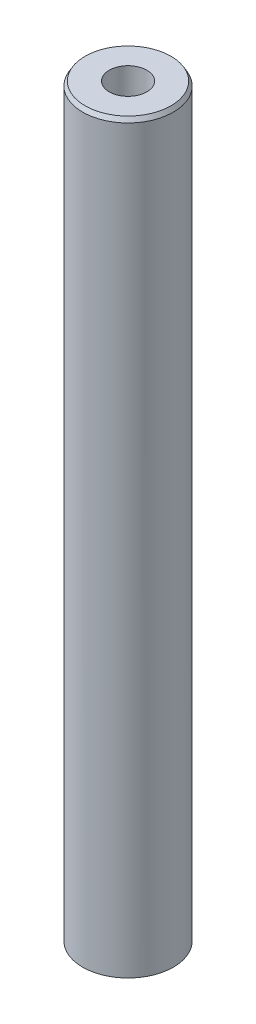
ISO-10303-21;
HEADER;
FILE_DESCRIPTION(('STEP AP214'),'2;1');
FILE_NAME('part.step','',(''),(''),'','','');
FILE_SCHEMA(('AUTOMOTIVE_DESIGN { 1 0 10303 214 1 1 1 1 }'));
ENDSEC;
DATA;
#1=APPLICATION_CONTEXT('core data for automotive mechanical design processes');
#2=APPLICATION_PROTOCOL_DEFINITION('international standard','automotive_design',2000,#1);
#3=PRODUCT_CONTEXT('',#1,'mechanical');
#4=PRODUCT('Part','Part','',(#3));
#5=PRODUCT_RELATED_PRODUCT_CATEGORY('part','',(#4));
#6=PRODUCT_DEFINITION_FORMATION('','',#4);
#7=PRODUCT_DEFINITION_CONTEXT('part definition',#1,'design');
#8=PRODUCT_DEFINITION('design','',#6,#7);
#9=PRODUCT_DEFINITION_SHAPE('','',#8);
#10=(LENGTH_UNIT() NAMED_UNIT(*) SI_UNIT(.MILLI.,.METRE.));
#11=(NAMED_UNIT(*) PLANE_ANGLE_UNIT() SI_UNIT($,.RADIAN.));
#12=(NAMED_UNIT(*) SI_UNIT($,.STERADIAN.) SOLID_ANGLE_UNIT());
#13=UNCERTAINTY_MEASURE_WITH_UNIT(LENGTH_MEASURE(1.E-05),#10,'distance_accuracy_value','');
#14=(GEOMETRIC_REPRESENTATION_CONTEXT(3) GLOBAL_UNCERTAINTY_ASSIGNED_CONTEXT((#13)) GLOBAL_UNIT_ASSIGNED_CONTEXT((#10,
#11,#12)) REPRESENTATION_CONTEXT('',''));
#15=CARTESIAN_POINT('',(0.,0.,0.));
#16=DIRECTION('',(0.,0.,1.));
#17=DIRECTION('',(1.,0.,0.));
#18=AXIS2_PLACEMENT_3D('',#15,#16,#17);
#19=CARTESIAN_POINT('',(0.,164.60756164385,0.));
#20=DIRECTION('',(0.,-1.,0.));
#21=DIRECTION('',(0.,0.,-1.));
#22=AXIS2_PLACEMENT_3D('',#19,#20,#21);
#23=CYLINDRICAL_SURFACE('',#22,10.);
#24=CARTESIAN_POINT('',(0.,163.669523991613,0.));
#25=DIRECTION('',(0.,1.,0.));
#26=DIRECTION('',(0.,0.,1.));
#27=AXIS2_PLACEMENT_3D('',#24,#25,#26);
#28=CIRCLE('',#27,10.);
#29=CARTESIAN_POINT('',(0.,163.669523991613,-10.));
#30=VERTEX_POINT('',#29);
#31=EDGE_CURVE('E50',#30,#30,#28,.F.);
#32=CARTESIAN_POINT('',(0.,0.541576291029106,0.));
#33=DIRECTION('',(0.,1.,0.));
#34=DIRECTION('',(0.,0.,1.));
#35=AXIS2_PLACEMENT_3D('',#32,#33,#34);
#36=CIRCLE('',#35,10.);
#37=CARTESIAN_POINT('',(0.,0.541576291029106,-10.));
#38=VERTEX_POINT('',#37);
#39=EDGE_CURVE('E51',#38,#38,#36,.T.);
#40=CARTESIAN_POINT('',(0.,163.669523991613,-10.));
#41=CARTESIAN_POINT('',(0.,161.970274536399,-10.));
#42=CARTESIAN_POINT('',(0.,160.271025081184,-10.));
#43=CARTESIAN_POINT('',(0.,156.872526170755,-10.));
#44=CARTESIAN_POINT('',(0.,155.173276715541,-10.));
#45=CARTESIAN_POINT('',(0.,151.774777805112,-10.));
#46=CARTESIAN_POINT('',(0.,150.075528349898,-10.));
#47=CARTESIAN_POINT('',(0.,146.677029439469,-10.));
#48=CARTESIAN_POINT('',(0.,144.977779984255,-10.));
#49=CARTESIAN_POINT('',(0.,141.579281073826,-10.));
#50=CARTESIAN_POINT('',(0.,139.880031618611,-10.));
#51=CARTESIAN_POINT('',(0.,136.481532708182,-10.));
#52=CARTESIAN_POINT('',(0.,134.782283252968,-10.));
#53=CARTESIAN_POINT('',(0.,131.383784342539,-10.));
#54=CARTESIAN_POINT('',(0.,129.684534887325,-10.));
#55=CARTESIAN_POINT('',(0.,126.286035976896,-10.));
#56=CARTESIAN_POINT('',(0.,124.586786521682,-10.));
#57=CARTESIAN_POINT('',(0.,121.188287611253,-10.));
#58=CARTESIAN_POINT('',(0.,119.489038156038,-10.));
#59=CARTESIAN_POINT('',(0.,116.090539245609,-10.));
#60=CARTESIAN_POINT('',(0.,114.391289790395,-10.));
#61=CARTESIAN_POINT('',(0.,110.992790879966,-10.));
#62=CARTESIAN_POINT('',(0.,109.293541424752,-10.));
#63=CARTESIAN_POINT('',(0.,105.895042514323,-10.));
#64=CARTESIAN_POINT('',(0.,104.195793059109,-10.));
#65=CARTESIAN_POINT('',(0.,100.79729414868,-10.));
#66=CARTESIAN_POINT('',(0.,99.0980446934653,-10.));
#67=CARTESIAN_POINT('',(0.,95.6995457830365,-10.));
#68=CARTESIAN_POINT('',(0.,94.0002963278221,-10.));
#69=CARTESIAN_POINT('',(0.,90.6017974173932,-10.));
#70=CARTESIAN_POINT('',(0.,88.9025479621788,-10.));
#71=CARTESIAN_POINT('',(0.,85.50404905175,-10.));
#72=CARTESIAN_POINT('',(0.,83.8047995965356,-10.));
#73=CARTESIAN_POINT('',(0.,80.4063006861067,-10.));
#74=CARTESIAN_POINT('',(0.,78.7070512308923,-10.));
#75=CARTESIAN_POINT('',(0.,75.3085523204635,-10.));
#76=CARTESIAN_POINT('',(0.,73.609302865249,-10.));
#77=CARTESIAN_POINT('',(0.,70.2108039548202,-10.));
#78=CARTESIAN_POINT('',(0.,68.5115544996058,-10.));
#79=CARTESIAN_POINT('',(0.,65.113055589177,-10.));
#80=CARTESIAN_POINT('',(0.,63.4138061339626,-10.));
#81=CARTESIAN_POINT('',(0.,60.0153072235337,-10.));
#82=CARTESIAN_POINT('',(0.,58.3160577683193,-10.));
#83=CARTESIAN_POINT('',(0.,54.9175588578905,-10.));
#84=CARTESIAN_POINT('',(0.,53.218309402676,-10.));
#85=CARTESIAN_POINT('',(0.,49.8198104922472,-10.));
#86=CARTESIAN_POINT('',(0.,48.1205610370328,-10.));
#87=CARTESIAN_POINT('',(0.,44.722062126604,-10.));
#88=CARTESIAN_POINT('',(0.,43.0228126713895,-10.));
#89=CARTESIAN_POINT('',(0.,39.6243137609607,-10.));
#90=CARTESIAN_POINT('',(0.,37.9250643057463,-10.));
#91=CARTESIAN_POINT('',(0.,34.5265653953174,-10.));
#92=CARTESIAN_POINT('',(0.,32.827315940103,-10.));
#93=CARTESIAN_POINT('',(0.,29.4288170296742,-10.));
#94=CARTESIAN_POINT('',(0.,27.7295675744598,-10.));
#95=CARTESIAN_POINT('',(0.,24.3310686640309,-10.));
#96=CARTESIAN_POINT('',(0.,22.6318192088165,-10.));
#97=CARTESIAN_POINT('',(0.,19.2333202983877,-10.));
#98=CARTESIAN_POINT('',(0.,17.5340708431733,-10.));
#99=CARTESIAN_POINT('',(0.,14.1355719327444,-10.));
#100=CARTESIAN_POINT('',(0.,12.43632247753,-10.));
#101=CARTESIAN_POINT('',(0.,9.03782356710119,-10.));
#102=CARTESIAN_POINT('',(0.,7.33857411188677,-10.));
#103=CARTESIAN_POINT('',(0.,3.94007520145794,-10.));
#104=CARTESIAN_POINT('',(0.,2.24082574624352,-10.));
#105=CARTESIAN_POINT('',(0.,0.541576291029106,-10.));
#106=B_SPLINE_CURVE_WITH_KNOTS('',3,(#40,#41,#42,#43,#44,#45,#46,#47,#48,#49,#50,#51,#52,#53,
#54,#55,#56,#57,#58,#59,#60,#61,#62,#63,#64,#65,#66,#67,#68,#69,#70,#71,#72,#73,#74,#75,#76,#77,
#78,#79,#80,#81,#82,#83,#84,#85,#86,#87,#88,#89,#90,#91,#92,#93,#94,#95,#96,#97,#98,#99,#100,
#101,#102,#103,#104,#105),.UNSPECIFIED.,.F.,.F.,(4,2,2,2,2,2,2,2,2,2,2,2,2,2,2,2,2,2,2,2,2,2,2,
2,2,2,2,2,2,2,2,2,4),(0.,5.09774836564322,10.1954967312865,15.2932450969297,20.390993462573,
25.4887418282162,30.5864901938595,35.6842385595027,40.781986925146,45.8797352907892,
50.9774836564325,56.0752320220757,61.172980387719,66.2707287533622,71.3684771190055,
76.4662254846487,81.563973850292,86.6617222159353,91.7594705815785,96.8572189472218,
101.954967312865,107.052715678508,112.150464044152,117.248212409795,122.345960775438,
127.443709141081,132.541457506725,137.639205872368,142.736954238011,147.834702603654,
152.932450969298,158.030199334941,163.127947700584),.UNSPECIFIED.);
#107=EDGE_CURVE('BSEAM39',#30,#38,#106,.T.);
#108=ORIENTED_EDGE('',*,*,#31,.T.);
#109=ORIENTED_EDGE('',*,*,#39,.T.);
#110=ORIENTED_EDGE('',*,*,#107,.T.);
#111=ORIENTED_EDGE('',*,*,#107,.F.);
#112=EDGE_LOOP('',(#108,#110,#109,#111));
#113=FACE_BOUND('',#112,.T.);
#114=ADVANCED_FACE('F39',(#113),#23,.T.);
#115=CARTESIAN_POINT('',(0.,164.60756164385,0.));
#116=DIRECTION('',(0.,1.,0.));
#117=DIRECTION('',(0.,0.,1.));
#118=AXIS2_PLACEMENT_3D('',#115,#116,#117);
#119=PLANE('',#118);
#120=CARTESIAN_POINT('',(0.,164.60756164385,0.));
#121=DIRECTION('',(0.,1.,0.));
#122=DIRECTION('',(0.,0.,1.));
#123=AXIS2_PLACEMENT_3D('',#120,#121,#122);
#124=CIRCLE('',#123,9.4584237089711);
#125=CARTESIAN_POINT('',(0.,164.60756164385,-9.45842370897111));
#126=VERTEX_POINT('',#125);
#127=EDGE_CURVE('E54',#126,#126,#124,.T.);
#128=ORIENTED_EDGE('',*,*,#127,.T.);
#129=EDGE_LOOP('',(#128));
#130=FACE_BOUND('',#129,.T.);
#131=CARTESIAN_POINT('',(0.,164.60756164385,0.));
#132=DIRECTION('',(0.,1.,0.));
#133=DIRECTION('',(0.,0.,1.));
#134=AXIS2_PLACEMENT_3D('',#131,#132,#133);
#135=CIRCLE('',#134,4.14096781980479);
#136=CARTESIAN_POINT('',(0.,164.60756164385,-4.14096781980479));
#137=VERTEX_POINT('',#136);
#138=EDGE_CURVE('E58',#137,#137,#135,.T.);
#139=ORIENTED_EDGE('',*,*,#138,.F.);
#140=EDGE_LOOP('',(#139));
#141=FACE_BOUND('',#140,.T.);
#142=ADVANCED_FACE('F69',(#130,#141),#119,.T.);
#143=CARTESIAN_POINT('',(0.,0.,0.));
#144=DIRECTION('',(0.,1.,0.));
#145=DIRECTION('',(0.,0.,1.));
#146=AXIS2_PLACEMENT_3D('',#143,#144,#145);
#147=PLANE('',#146);
#148=CARTESIAN_POINT('',(0.,0.,0.));
#149=DIRECTION('',(0.,1.,0.));
#150=DIRECTION('',(0.,0.,1.));
#151=AXIS2_PLACEMENT_3D('',#148,#149,#150);
#152=CIRCLE('',#151,9.06196234776291);
#153=CARTESIAN_POINT('',(0.,0.,9.06196234776291));
#154=VERTEX_POINT('',#153);
#155=EDGE_CURVE('E10',#154,#154,#152,.F.);
#156=ORIENTED_EDGE('',*,*,#155,.T.);
#157=EDGE_LOOP('',(#156));
#158=FACE_BOUND('',#157,.T.);
#159=CARTESIAN_POINT('',(0.,0.,0.));
#160=DIRECTION('',(0.,1.,0.));
#161=DIRECTION('',(0.,0.,1.));
#162=AXIS2_PLACEMENT_3D('',#159,#160,#161);
#163=CIRCLE('',#162,4.14096781980479);
#164=CARTESIAN_POINT('',(0.,0.,-4.14096781980479));
#165=VERTEX_POINT('',#164);
#166=EDGE_CURVE('E63',#165,#165,#163,.T.);
#167=ORIENTED_EDGE('',*,*,#166,.T.);
#168=EDGE_LOOP('',(#167));
#169=FACE_BOUND('',#168,.T.);
#170=ADVANCED_FACE('F75',(#158,#169),#147,.F.);
#171=CARTESIAN_POINT('',(0.,164.60756164385,0.));
#172=DIRECTION('',(0.,-1.,0.));
#173=DIRECTION('',(0.,0.,-1.));
#174=AXIS2_PLACEMENT_3D('',#171,#172,#173);
#175=CYLINDRICAL_SURFACE('',#174,4.14096781980479);
#176=CARTESIAN_POINT('',(0.,164.60756164385,-4.14096781980479));
#177=CARTESIAN_POINT('',(0.,162.892899543393,-4.14096781980479));
#178=CARTESIAN_POINT('',(0.,161.178237442936,-4.14096781980479));
#179=CARTESIAN_POINT('',(0.,157.748913242023,-4.14096781980479));
#180=CARTESIAN_POINT('',(0.,156.034251141566,-4.14096781980479));
#181=CARTESIAN_POINT('',(0.,152.604926940653,-4.14096781980479));
#182=CARTESIAN_POINT('',(0.,150.890264840196,-4.14096781980479));
#183=CARTESIAN_POINT('',(0.,147.460940639282,-4.14096781980479));
#184=CARTESIAN_POINT('',(0.,145.746278538825,-4.14096781980479));
#185=CARTESIAN_POINT('',(0.,142.316954337912,-4.14096781980479));
#186=CARTESIAN_POINT('',(0.,140.602292237455,-4.14096781980479));
#187=CARTESIAN_POINT('',(0.,137.172968036542,-4.14096781980479));
#188=CARTESIAN_POINT('',(0.,135.458305936085,-4.14096781980479));
#189=CARTESIAN_POINT('',(0.,132.028981735171,-4.14096781980479));
#190=CARTESIAN_POINT('',(0.,130.314319634714,-4.14096781980479));
#191=CARTESIAN_POINT('',(0.,126.884995433801,-4.14096781980479));
#192=CARTESIAN_POINT('',(0.,125.170333333344,-4.14096781980479));
#193=CARTESIAN_POINT('',(0.,121.741009132431,-4.14096781980479));
#194=CARTESIAN_POINT('',(0.,120.026347031974,-4.14096781980479));
#195=CARTESIAN_POINT('',(0.,116.59702283106,-4.14096781980479));
#196=CARTESIAN_POINT('',(0.,114.882360730604,-4.14096781980479));
#197=CARTESIAN_POINT('',(0.,111.45303652969,-4.14096781980479));
#198=CARTESIAN_POINT('',(0.,109.738374429233,-4.14096781980479));
#199=CARTESIAN_POINT('',(0.,106.30905022832,-4.14096781980479));
#200=CARTESIAN_POINT('',(0.,104.594388127863,-4.14096781980479));
#201=CARTESIAN_POINT('',(0.,101.165063926949,-4.14096781980479));
#202=CARTESIAN_POINT('',(0.,99.4504018264927,-4.14096781980479));
#203=CARTESIAN_POINT('',(0.,96.0210776255791,-4.14096781980479));
#204=CARTESIAN_POINT('',(0.,94.3064155251223,-4.14096781980479));
#205=CARTESIAN_POINT('',(0.,90.8770913242088,-4.14096781980479));
#206=CARTESIAN_POINT('',(0.,89.162429223752,-4.14096781980479));
#207=CARTESIAN_POINT('',(0.,85.7331050228385,-4.14096781980479));
#208=CARTESIAN_POINT('',(0.,84.0184429223817,-4.14096781980479));
#209=CARTESIAN_POINT('',(0.,80.5891187214682,-4.14096781980479));
#210=CARTESIAN_POINT('',(0.,78.8744566210114,-4.14096781980479));
#211=CARTESIAN_POINT('',(0.,75.4451324200979,-4.14096781980479));
#212=CARTESIAN_POINT('',(0.,73.7304703196411,-4.14096781980479));
#213=CARTESIAN_POINT('',(0.,70.3011461187275,-4.14096781980479));
#214=CARTESIAN_POINT('',(0.,68.5864840182708,-4.14096781980479));
#215=CARTESIAN_POINT('',(0.,65.1571598173572,-4.14096781980479));
#216=CARTESIAN_POINT('',(0.,63.4424977169005,-4.14096781980479));
#217=CARTESIAN_POINT('',(0.,60.0131735159869,-4.14096781980479));
#218=CARTESIAN_POINT('',(0.,58.2985114155301,-4.14096781980479));
#219=CARTESIAN_POINT('',(0.,54.8691872146166,-4.14096781980479));
#220=CARTESIAN_POINT('',(0.,53.1545251141598,-4.14096781980479));
#221=CARTESIAN_POINT('',(0.,49.7252009132463,-4.14096781980479));
#222=CARTESIAN_POINT('',(0.,48.0105388127895,-4.14096781980479));
#223=CARTESIAN_POINT('',(0.,44.581214611876,-4.14096781980479));
#224=CARTESIAN_POINT('',(0.,42.8665525114192,-4.14096781980479));
#225=CARTESIAN_POINT('',(0.,39.4372283105057,-4.14096781980479));
#226=CARTESIAN_POINT('',(0.,37.7225662100489,-4.14096781980479));
#227=CARTESIAN_POINT('',(0.,34.2932420091354,-4.14096781980479));
#228=CARTESIAN_POINT('',(0.,32.5785799086786,-4.14096781980479));
#229=CARTESIAN_POINT('',(0.,29.1492557077651,-4.14096781980479));
#230=CARTESIAN_POINT('',(0.,27.4345936073083,-4.14096781980479));
#231=CARTESIAN_POINT('',(0.,24.0052694063948,-4.14096781980479));
#232=CARTESIAN_POINT('',(0.,22.290607305938,-4.14096781980479));
#233=CARTESIAN_POINT('',(0.,18.8612831050245,-4.14096781980479));
#234=CARTESIAN_POINT('',(0.,17.1466210045677,-4.14096781980479));
#235=CARTESIAN_POINT('',(0.,13.7172968036541,-4.14096781980479));
#236=CARTESIAN_POINT('',(0.,12.0026347031974,-4.14096781980479));
#237=CARTESIAN_POINT('',(0.,8.57331050228382,-4.14096781980479));
#238=CARTESIAN_POINT('',(0.,6.85864840182705,-4.14096781980479));
#239=CARTESIAN_POINT('',(0.,3.42932420091351,-4.14096781980479));
#240=CARTESIAN_POINT('',(0.,1.71466210045674,-4.14096781980479));
#241=CARTESIAN_POINT('',(0.,0.,-4.14096781980479));
#242=B_SPLINE_CURVE_WITH_KNOTS('',3,(#176,#177,#178,#179,#180,#181,#182,#183,#184,#185,#186,
#187,#188,#189,#190,#191,#192,#193,#194,#195,#196,#197,#198,#199,#200,#201,#202,#203,#204,#205,
#206,#207,#208,#209,#210,#211,#212,#213,#214,#215,#216,#217,#218,#219,#220,#221,#222,#223,#224,
#225,#226,#227,#228,#229,#230,#231,#232,#233,#234,#235,#236,#237,#238,#239,#240,#241),
.UNSPECIFIED.,.F.,.F.,(4,2,2,2,2,2,2,2,2,2,2,2,2,2,2,2,2,2,2,2,2,2,2,2,2,2,2,2,2,2,2,2,4),(0.,
5.14398630137033,10.2879726027406,15.4319589041109,20.5759452054813,25.7199315068516,
30.8639178082219,36.0079041095922,41.1518904109625,46.2958767123328,51.4398630137031,
56.5838493150734,61.7278356164438,66.8718219178141,72.0158082191844,77.1597945205547,
82.303780821925,87.4477671232953,92.5917534246656,97.7357397260359,102.879726027406,
108.023712328777,113.167698630147,118.311684931517,123.455671232887,128.599657534258,
133.743643835628,138.887630136998,144.031616438369,149.175602739739,154.319589041109,
159.46357534248,164.60756164385),.UNSPECIFIED.);
#243=EDGE_CURVE('BSEAM70',#137,#165,#242,.T.);
#244=ORIENTED_EDGE('',*,*,#138,.T.);
#245=ORIENTED_EDGE('',*,*,#166,.F.);
#246=ORIENTED_EDGE('',*,*,#243,.T.);
#247=ORIENTED_EDGE('',*,*,#243,.F.);
#248=EDGE_LOOP('',(#244,#246,#245,#247));
#249=FACE_BOUND('',#248,.T.);
#250=ADVANCED_FACE('F70',(#249),#175,.F.);
#251=CARTESIAN_POINT('',(0.,164.60756164385,0.));
#252=DIRECTION('',(0.,-1.,0.));
#253=DIRECTION('',(0.,0.,-1.));
#254=AXIS2_PLACEMENT_3D('',#251,#252,#253);
#255=CONICAL_SURFACE('',#254,9.4584237089711,0.523598775598299);
#256=CARTESIAN_POINT('',(0.,163.669523991613,-10.));
#257=CARTESIAN_POINT('',(0.,163.679295217157,-9.99435858030179));
#258=CARTESIAN_POINT('',(0.,163.689066442701,-9.98871716060358));
#259=CARTESIAN_POINT('',(0.,163.70860889379,-9.97743432120714));
#260=CARTESIAN_POINT('',(0.,163.718380119334,-9.97179290150892));
#261=CARTESIAN_POINT('',(0.,163.737922570422,-9.96051006211248));
#262=CARTESIAN_POINT('',(0.,163.747693795966,-9.95486864241427));
#263=CARTESIAN_POINT('',(0.,163.767236247054,-9.94358580301783));
#264=CARTESIAN_POINT('',(0.,163.777007472599,-9.93794438331961));
#265=CARTESIAN_POINT('',(0.,163.796549923687,-9.92666154392318));
#266=CARTESIAN_POINT('',(0.,163.806321149231,-9.92102012422496));
#267=CARTESIAN_POINT('',(0.,163.825863600319,-9.90973728482853));
#268=CARTESIAN_POINT('',(0.,163.835634825863,-9.90409586513031));
#269=CARTESIAN_POINT('',(0.,163.855177276952,-9.89281302573387));
#270=CARTESIAN_POINT('',(0.,163.864948502496,-9.88717160603565));
#271=CARTESIAN_POINT('',(0.,163.884490953584,-9.87588876663922));
#272=CARTESIAN_POINT('',(0.,163.894262179128,-9.870247346941));
#273=CARTESIAN_POINT('',(0.,163.913804630216,-9.85896450754456));
#274=CARTESIAN_POINT('',(0.,163.923575855761,-9.85332308784635));
#275=CARTESIAN_POINT('',(0.,163.943118306849,-9.84204024844991));
#276=CARTESIAN_POINT('',(0.,163.952889532393,-9.83639882875169));
#277=CARTESIAN_POINT('',(0.,163.972431983481,-9.82511598935526));
#278=CARTESIAN_POINT('',(0.,163.982203209025,-9.81947456965704));
#279=CARTESIAN_POINT('',(0.,164.001745660114,-9.8081917302606));
#280=CARTESIAN_POINT('',(0.,164.011516885658,-9.80255031056238));
#281=CARTESIAN_POINT('',(0.,164.031059336746,-9.79126747116595));
#282=CARTESIAN_POINT('',(0.,164.04083056229,-9.78562605146774));
#283=CARTESIAN_POINT('',(0.,164.060373013378,-9.7743432120713));
#284=CARTESIAN_POINT('',(0.,164.070144238923,-9.76870179237308));
#285=CARTESIAN_POINT('',(0.,164.089686690011,-9.75741895297665));
#286=CARTESIAN_POINT('',(0.,164.099457915555,-9.75177753327843));
#287=CARTESIAN_POINT('',(0.,164.119000366643,-9.74049469388199));
#288=CARTESIAN_POINT('',(0.,164.128771592187,-9.73485327418377));
#289=CARTESIAN_POINT('',(0.,164.148314043276,-9.72357043478734));
#290=CARTESIAN_POINT('',(0.,164.15808526882,-9.71792901508912));
#291=CARTESIAN_POINT('',(0.,164.177627719908,-9.70664617569269));
#292=CARTESIAN_POINT('',(0.,164.187398945452,-9.70100475599447));
#293=CARTESIAN_POINT('',(0.,164.20694139654,-9.68972191659803));
#294=CARTESIAN_POINT('',(0.,164.216712622085,-9.68408049689982));
#295=CARTESIAN_POINT('',(0.,164.236255073173,-9.67279765750338));
#296=CARTESIAN_POINT('',(0.,164.246026298717,-9.66715623780516));
#297=CARTESIAN_POINT('',(0.,164.265568749805,-9.65587339840872));
#298=CARTESIAN_POINT('',(0.,164.275339975349,-9.65023197871051));
#299=CARTESIAN_POINT('',(0.,164.294882426438,-9.63894913931408));
#300=CARTESIAN_POINT('',(0.,164.304653651982,-9.63330771961586));
#301=CARTESIAN_POINT('',(0.,164.32419610307,-9.62202488021942));
#302=CARTESIAN_POINT('',(0.,164.333967328614,-9.6163834605212));
#303=CARTESIAN_POINT('',(0.,164.353509779702,-9.60510062112476));
#304=CARTESIAN_POINT('',(0.,164.363281005247,-9.59945920142655));
#305=CARTESIAN_POINT('',(0.,164.382823456335,-9.58817636203012));
#306=CARTESIAN_POINT('',(0.,164.392594681879,-9.5825349423319));
#307=CARTESIAN_POINT('',(0.,164.412137132967,-9.57125210293546));
#308=CARTESIAN_POINT('',(0.,164.421908358511,-9.56561068323724));
#309=CARTESIAN_POINT('',(0.,164.4414508096,-9.55432784384081));
#310=CARTESIAN_POINT('',(0.,164.451222035144,-9.54868642414259));
#311=CARTESIAN_POINT('',(0.,164.470764486232,-9.53740358474615));
#312=CARTESIAN_POINT('',(0.,164.480535711776,-9.53176216504794));
#313=CARTESIAN_POINT('',(0.,164.500078162864,-9.5204793256515));
#314=CARTESIAN_POINT('',(0.,164.509849388409,-9.51483790595328));
#315=CARTESIAN_POINT('',(0.,164.529391839497,-9.50355506655685));
#316=CARTESIAN_POINT('',(0.,164.539163065041,-9.49791364685863));
#317=CARTESIAN_POINT('',(0.,164.558705516129,-9.48663080746219));
#318=CARTESIAN_POINT('',(0.,164.568476741673,-9.48098938776397));
#319=CARTESIAN_POINT('',(0.,164.588019192762,-9.46970654836754));
#320=CARTESIAN_POINT('',(0.,164.597790418306,-9.46406512866932));
#321=CARTESIAN_POINT('',(0.,164.60756164385,-9.45842370897111));
#322=B_SPLINE_CURVE_WITH_KNOTS('',3,(#256,#257,#258,#259,#260,#261,#262,#263,#264,#265,#266,
#267,#268,#269,#270,#271,#272,#273,#274,#275,#276,#277,#278,#279,#280,#281,#282,#283,#284,#285,
#286,#287,#288,#289,#290,#291,#292,#293,#294,#295,#296,#297,#298,#299,#300,#301,#302,#303,#304,
#305,#306,#307,#308,#309,#310,#311,#312,#313,#314,#315,#316,#317,#318,#319,#320,#321),
.UNSPECIFIED.,.F.,.F.,(4,2,2,2,2,2,2,2,2,2,2,2,2,2,2,2,2,2,2,2,2,2,2,2,2,2,2,2,2,2,2,2,4),(0.,
0.0338485181893246,0.0676970363786251,0.101545554567926,0.135394072757226,0.169242590946551,
0.20309110913585,0.236939627325151,0.270788145514451,0.304636663703776,0.338485181893076,
0.372333700082377,0.406182218271676,0.440030736461001,0.473879254650302,0.507727772839602,
0.541576291028903,0.575424809218227,0.609273327407528,0.643121845596828,0.676970363786128,
0.710818881975453,0.744667400164753,0.778515918354054,0.812364436543378,0.846212954732678,
0.880061472921978,0.913909991111279,0.947758509300603,0.981607027489904,1.0154555456792,
1.0493040638685,1.08315258205783),.UNSPECIFIED.);
#323=EDGE_CURVE('BSEAM81',#30,#126,#322,.T.);
#324=ORIENTED_EDGE('',*,*,#31,.F.);
#325=ORIENTED_EDGE('',*,*,#127,.F.);
#326=ORIENTED_EDGE('',*,*,#323,.T.);
#327=ORIENTED_EDGE('',*,*,#323,.F.);
#328=EDGE_LOOP('',(#324,#326,#325,#327));
#329=FACE_BOUND('',#328,.T.);
#330=ADVANCED_FACE('F81',(#329),#255,.T.);
#331=CARTESIAN_POINT('',(0.,0.541576291029106,0.));
#332=DIRECTION('',(0.,1.,0.));
#333=DIRECTION('',(0.,0.,1.));
#334=AXIS2_PLACEMENT_3D('',#331,#332,#333);
#335=CONICAL_SURFACE('',#334,10.,1.04719755119658);
#336=ORIENTED_EDGE('',*,*,#155,.F.);
#337=EDGE_LOOP('',(#336));
#338=FACE_BOUND('',#337,.T.);
#339=ORIENTED_EDGE('',*,*,#39,.F.);
#340=EDGE_LOOP('',(#339));
#341=FACE_BOUND('',#340,.T.);
#342=ADVANCED_FACE('F45',(#338,#341),#335,.T.);
#343=CLOSED_SHELL('',(#114,#142,#170,#250,#330,#342));
#344=MANIFOLD_SOLID_BREP('B2',#343);
#345=ADVANCED_BREP_SHAPE_REPRESENTATION('',(#18,#344),#14);
#346=SHAPE_DEFINITION_REPRESENTATION(#9,#345);
ENDSEC;
END-ISO-10303-21;
